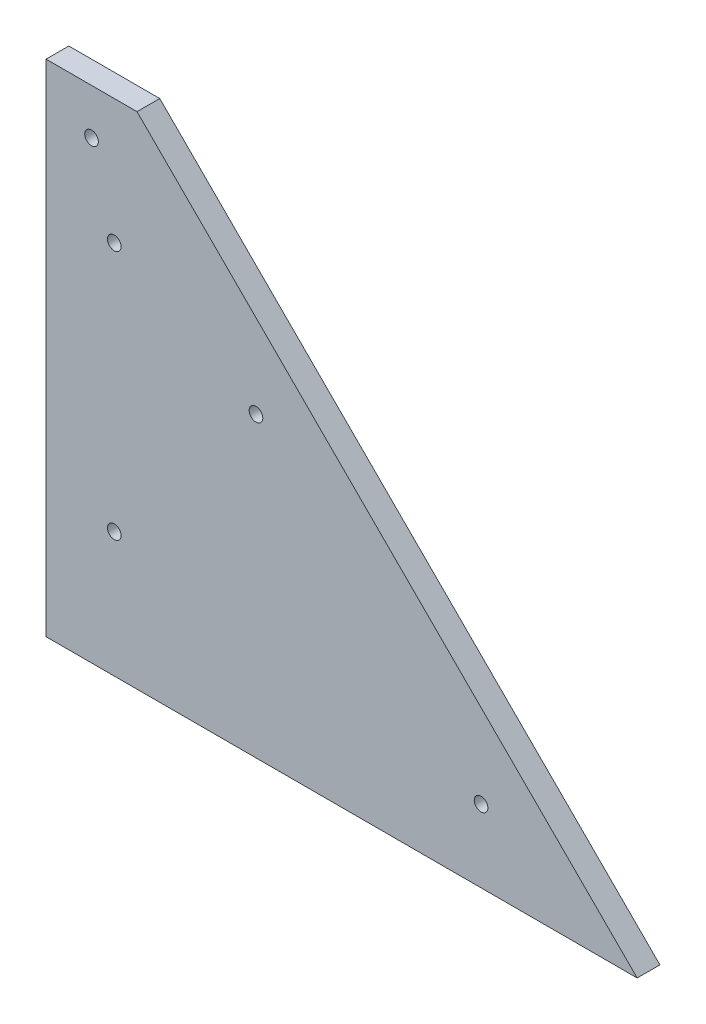
ISO-10303-21;
HEADER;
FILE_DESCRIPTION(('STEP AP214'),'2;1');
FILE_NAME('part.step','',(''),(''),'','','');
FILE_SCHEMA(('AUTOMOTIVE_DESIGN { 1 0 10303 214 1 1 1 1 }'));
ENDSEC;
DATA;
#1=APPLICATION_CONTEXT('core data for automotive mechanical design processes');
#2=APPLICATION_PROTOCOL_DEFINITION('international standard','automotive_design',2000,#1);
#3=PRODUCT_CONTEXT('',#1,'mechanical');
#4=PRODUCT('Part','Part','',(#3));
#5=PRODUCT_RELATED_PRODUCT_CATEGORY('part','',(#4));
#6=PRODUCT_DEFINITION_FORMATION('','',#4);
#7=PRODUCT_DEFINITION_CONTEXT('part definition',#1,'design');
#8=PRODUCT_DEFINITION('design','',#6,#7);
#9=PRODUCT_DEFINITION_SHAPE('','',#8);
#10=(LENGTH_UNIT() NAMED_UNIT(*) SI_UNIT(.MILLI.,.METRE.));
#11=(NAMED_UNIT(*) PLANE_ANGLE_UNIT() SI_UNIT($,.RADIAN.));
#12=(NAMED_UNIT(*) SI_UNIT($,.STERADIAN.) SOLID_ANGLE_UNIT());
#13=UNCERTAINTY_MEASURE_WITH_UNIT(LENGTH_MEASURE(1.E-05),#10,'distance_accuracy_value','');
#14=(GEOMETRIC_REPRESENTATION_CONTEXT(3) GLOBAL_UNCERTAINTY_ASSIGNED_CONTEXT((#13)) GLOBAL_UNIT_ASSIGNED_CONTEXT((#10,
#11,#12)) REPRESENTATION_CONTEXT('',''));
#15=CARTESIAN_POINT('',(0.,0.,0.));
#16=DIRECTION('',(0.,0.,1.));
#17=DIRECTION('',(1.,0.,0.));
#18=AXIS2_PLACEMENT_3D('',#15,#16,#17);
#19=CARTESIAN_POINT('',(0.,0.,5.));
#20=DIRECTION('',(0.,1.,0.));
#21=DIRECTION('',(0.,0.,1.));
#22=AXIS2_PLACEMENT_3D('',#19,#20,#21);
#23=PLANE('',#22);
#24=DIRECTION('',(1.,0.,0.));
#25=VECTOR('',#24,1.);
#26=CARTESIAN_POINT('',(0.,0.,0.));
#27=LINE('',#26,#25);
#28=CARTESIAN_POINT('',(0.,0.,0.));
#29=VERTEX_POINT('',#28);
#30=CARTESIAN_POINT('',(130.000000000001,0.,0.));
#31=VERTEX_POINT('',#30);
#32=EDGE_CURVE('E97',#29,#31,#27,.T.);
#33=ORIENTED_EDGE('',*,*,#32,.T.);
#34=DIRECTION('',(0.,0.,-1.));
#35=VECTOR('',#34,1.);
#36=CARTESIAN_POINT('',(130.000000000001,0.,5.));
#37=LINE('',#36,#35);
#38=CARTESIAN_POINT('',(130.000000000001,0.,5.));
#39=VERTEX_POINT('',#38);
#40=EDGE_CURVE('E11',#39,#31,#37,.T.);
#41=ORIENTED_EDGE('',*,*,#40,.F.);
#42=DIRECTION('',(1.,0.,0.));
#43=VECTOR('',#42,1.);
#44=CARTESIAN_POINT('',(0.,0.,5.));
#45=LINE('',#44,#43);
#46=CARTESIAN_POINT('',(0.,0.,5.));
#47=VERTEX_POINT('',#46);
#48=EDGE_CURVE('E85',#47,#39,#45,.T.);
#49=ORIENTED_EDGE('',*,*,#48,.F.);
#50=DIRECTION('',(0.,0.,-1.));
#51=VECTOR('',#50,1.);
#52=CARTESIAN_POINT('',(0.,0.,5.));
#53=LINE('',#52,#51);
#54=EDGE_CURVE('E93',#47,#29,#53,.T.);
#55=ORIENTED_EDGE('',*,*,#54,.T.);
#56=EDGE_LOOP('',(#33,#41,#49,#55));
#57=FACE_BOUND('',#56,.T.);
#58=ADVANCED_FACE('F34',(#57),#23,.F.);
#59=CARTESIAN_POINT('',(20.,110.,5.));
#60=DIRECTION('',(-0.707106781186543,-0.707106781186552,0.));
#61=DIRECTION('',(0.707106781186552,-0.707106781186543,0.));
#62=AXIS2_PLACEMENT_3D('',#59,#60,#61);
#63=PLANE('',#62);
#64=DIRECTION('',(-0.707106781186552,0.707106781186543,0.));
#65=VECTOR('',#64,1.);
#66=CARTESIAN_POINT('',(20.,110.,0.));
#67=LINE('',#66,#65);
#68=CARTESIAN_POINT('',(20.,110.,0.));
#69=VERTEX_POINT('',#68);
#70=EDGE_CURVE('E89',#31,#69,#67,.T.);
#71=ORIENTED_EDGE('',*,*,#70,.T.);
#72=DIRECTION('',(0.,0.,-1.));
#73=VECTOR('',#72,1.);
#74=CARTESIAN_POINT('',(20.,110.,5.));
#75=LINE('',#74,#73);
#76=CARTESIAN_POINT('',(20.,110.,5.));
#77=VERTEX_POINT('',#76);
#78=EDGE_CURVE('E42',#77,#69,#75,.T.);
#79=ORIENTED_EDGE('',*,*,#78,.F.);
#80=DIRECTION('',(-0.707106781186552,0.707106781186543,0.));
#81=VECTOR('',#80,1.);
#82=CARTESIAN_POINT('',(20.,110.,5.));
#83=LINE('',#82,#81);
#84=EDGE_CURVE('E80',#39,#77,#83,.T.);
#85=ORIENTED_EDGE('',*,*,#84,.F.);
#86=ORIENTED_EDGE('',*,*,#40,.T.);
#87=EDGE_LOOP('',(#71,#79,#85,#86));
#88=FACE_BOUND('',#87,.T.);
#89=ADVANCED_FACE('F88',(#88),#63,.F.);
#90=CARTESIAN_POINT('',(0.,110.,5.));
#91=DIRECTION('',(0.,-1.,0.));
#92=DIRECTION('',(0.,0.,-1.));
#93=AXIS2_PLACEMENT_3D('',#90,#91,#92);
#94=PLANE('',#93);
#95=DIRECTION('',(-1.,0.,0.));
#96=VECTOR('',#95,1.);
#97=CARTESIAN_POINT('',(0.,110.,0.));
#98=LINE('',#97,#96);
#99=CARTESIAN_POINT('',(0.,110.,0.));
#100=VERTEX_POINT('',#99);
#101=EDGE_CURVE('E67',#69,#100,#98,.T.);
#102=ORIENTED_EDGE('',*,*,#101,.T.);
#103=DIRECTION('',(0.,0.,-1.));
#104=VECTOR('',#103,1.);
#105=CARTESIAN_POINT('',(0.,110.,5.));
#106=LINE('',#105,#104);
#107=CARTESIAN_POINT('',(0.,110.,5.));
#108=VERTEX_POINT('',#107);
#109=EDGE_CURVE('E90',#108,#100,#106,.T.);
#110=ORIENTED_EDGE('',*,*,#109,.F.);
#111=DIRECTION('',(-1.,0.,0.));
#112=VECTOR('',#111,1.);
#113=CARTESIAN_POINT('',(0.,110.,5.));
#114=LINE('',#113,#112);
#115=EDGE_CURVE('E83',#77,#108,#114,.T.);
#116=ORIENTED_EDGE('',*,*,#115,.F.);
#117=ORIENTED_EDGE('',*,*,#78,.T.);
#118=EDGE_LOOP('',(#102,#110,#116,#117));
#119=FACE_BOUND('',#118,.T.);
#120=ADVANCED_FACE('F91',(#119),#94,.F.);
#121=CARTESIAN_POINT('',(0.,0.,5.));
#122=DIRECTION('',(1.,0.,0.));
#123=DIRECTION('',(0.,0.,-1.));
#124=AXIS2_PLACEMENT_3D('',#121,#122,#123);
#125=PLANE('',#124);
#126=DIRECTION('',(0.,-1.,0.));
#127=VECTOR('',#126,1.);
#128=CARTESIAN_POINT('',(0.,0.,0.));
#129=LINE('',#128,#127);
#130=EDGE_CURVE('E73',#100,#29,#129,.T.);
#131=ORIENTED_EDGE('',*,*,#130,.T.);
#132=ORIENTED_EDGE('',*,*,#54,.F.);
#133=DIRECTION('',(0.,-1.,0.));
#134=VECTOR('',#133,1.);
#135=CARTESIAN_POINT('',(0.,0.,5.));
#136=LINE('',#135,#134);
#137=EDGE_CURVE('E50',#108,#47,#136,.T.);
#138=ORIENTED_EDGE('',*,*,#137,.F.);
#139=ORIENTED_EDGE('',*,*,#109,.T.);
#140=EDGE_LOOP('',(#131,#132,#138,#139));
#141=FACE_BOUND('',#140,.T.);
#142=ADVANCED_FACE('F105',(#141),#125,.F.);
#143=CARTESIAN_POINT('',(0.,0.,5.));
#144=DIRECTION('',(0.,0.,1.));
#145=DIRECTION('',(1.,0.,0.));
#146=AXIS2_PLACEMENT_3D('',#143,#144,#145);
#147=PLANE('',#146);
#148=CARTESIAN_POINT('',(10.,100.,5.));
#149=DIRECTION('',(0.,0.,1.));
#150=DIRECTION('',(1.,0.,0.));
#151=AXIS2_PLACEMENT_3D('',#148,#149,#150);
#152=CIRCLE('',#151,1.5);
#153=CARTESIAN_POINT('',(11.5,100.,5.));
#154=VERTEX_POINT('',#153);
#155=EDGE_CURVE('E135',#154,#154,#152,.T.);
#156=ORIENTED_EDGE('',*,*,#155,.F.);
#157=EDGE_LOOP('',(#156));
#158=FACE_BOUND('',#157,.T.);
#159=CARTESIAN_POINT('',(46.1629509039029,65.4522727852482,5.));
#160=DIRECTION('',(0.,0.,1.));
#161=DIRECTION('',(1.,0.,0.));
#162=AXIS2_PLACEMENT_3D('',#159,#160,#161);
#163=CIRCLE('',#162,1.5);
#164=CARTESIAN_POINT('',(47.6629509039029,65.4522727852482,5.));
#165=VERTEX_POINT('',#164);
#166=EDGE_CURVE('E130',#165,#165,#163,.T.);
#167=ORIENTED_EDGE('',*,*,#166,.F.);
#168=EDGE_LOOP('',(#167));
#169=FACE_BOUND('',#168,.T.);
#170=CARTESIAN_POINT('',(95.6604255869613,15.9547981021899,5.));
#171=DIRECTION('',(0.,0.,1.));
#172=DIRECTION('',(-1.,0.,0.));
#173=AXIS2_PLACEMENT_3D('',#170,#171,#172);
#174=CIRCLE('',#173,1.50000000000001);
#175=CARTESIAN_POINT('',(94.1604255869612,15.9547981021899,5.));
#176=VERTEX_POINT('',#175);
#177=EDGE_CURVE('E123',#176,#176,#174,.T.);
#178=ORIENTED_EDGE('',*,*,#177,.F.);
#179=EDGE_LOOP('',(#178));
#180=FACE_BOUND('',#179,.T.);
#181=CARTESIAN_POINT('',(15.,82.5,5.));
#182=DIRECTION('',(0.,0.,1.));
#183=DIRECTION('',(1.,0.,0.));
#184=AXIS2_PLACEMENT_3D('',#181,#182,#183);
#185=CIRCLE('',#184,1.5);
#186=CARTESIAN_POINT('',(16.5,82.5,5.));
#187=VERTEX_POINT('',#186);
#188=EDGE_CURVE('E118',#187,#187,#185,.T.);
#189=ORIENTED_EDGE('',*,*,#188,.F.);
#190=EDGE_LOOP('',(#189));
#191=FACE_BOUND('',#190,.T.);
#192=CARTESIAN_POINT('',(15.,27.5,5.));
#193=DIRECTION('',(0.,0.,1.));
#194=DIRECTION('',(-1.,0.,0.));
#195=AXIS2_PLACEMENT_3D('',#192,#193,#194);
#196=CIRCLE('',#195,1.5);
#197=CARTESIAN_POINT('',(13.5,27.5,5.));
#198=VERTEX_POINT('',#197);
#199=EDGE_CURVE('E111',#198,#198,#196,.T.);
#200=ORIENTED_EDGE('',*,*,#199,.F.);
#201=EDGE_LOOP('',(#200));
#202=FACE_BOUND('',#201,.T.);
#203=ORIENTED_EDGE('',*,*,#48,.T.);
#204=ORIENTED_EDGE('',*,*,#84,.T.);
#205=ORIENTED_EDGE('',*,*,#115,.T.);
#206=ORIENTED_EDGE('',*,*,#137,.T.);
#207=EDGE_LOOP('',(#203,#204,#205,#206));
#208=FACE_BOUND('',#207,.T.);
#209=ADVANCED_FACE('F81',(#158,#169,#180,#191,#202,#208),#147,.T.);
#210=CARTESIAN_POINT('',(0.,0.,0.));
#211=DIRECTION('',(0.,0.,1.));
#212=DIRECTION('',(1.,0.,0.));
#213=AXIS2_PLACEMENT_3D('',#210,#211,#212);
#214=PLANE('',#213);
#215=CARTESIAN_POINT('',(10.,100.,0.));
#216=DIRECTION('',(0.,0.,1.));
#217=DIRECTION('',(1.,0.,0.));
#218=AXIS2_PLACEMENT_3D('',#215,#216,#217);
#219=CIRCLE('',#218,1.5);
#220=CARTESIAN_POINT('',(11.5,100.,0.));
#221=VERTEX_POINT('',#220);
#222=EDGE_CURVE('E127',#221,#221,#219,.T.);
#223=ORIENTED_EDGE('',*,*,#222,.T.);
#224=EDGE_LOOP('',(#223));
#225=FACE_BOUND('',#224,.T.);
#226=CARTESIAN_POINT('',(46.1629509039029,65.4522727852482,0.));
#227=DIRECTION('',(0.,0.,1.));
#228=DIRECTION('',(1.,0.,0.));
#229=AXIS2_PLACEMENT_3D('',#226,#227,#228);
#230=CIRCLE('',#229,1.5);
#231=CARTESIAN_POINT('',(47.6629509039029,65.4522727852482,0.));
#232=VERTEX_POINT('',#231);
#233=EDGE_CURVE('E115',#232,#232,#230,.T.);
#234=ORIENTED_EDGE('',*,*,#233,.T.);
#235=EDGE_LOOP('',(#234));
#236=FACE_BOUND('',#235,.T.);
#237=CARTESIAN_POINT('',(95.6604255869613,15.9547981021899,0.));
#238=DIRECTION('',(0.,0.,1.));
#239=DIRECTION('',(-1.,0.,0.));
#240=AXIS2_PLACEMENT_3D('',#237,#238,#239);
#241=CIRCLE('',#240,1.50000000000001);
#242=CARTESIAN_POINT('',(94.1604255869612,15.9547981021899,0.));
#243=VERTEX_POINT('',#242);
#244=EDGE_CURVE('E126',#243,#243,#241,.T.);
#245=ORIENTED_EDGE('',*,*,#244,.T.);
#246=EDGE_LOOP('',(#245));
#247=FACE_BOUND('',#246,.T.);
#248=CARTESIAN_POINT('',(15.,82.5,0.));
#249=DIRECTION('',(0.,0.,1.));
#250=DIRECTION('',(1.,0.,0.));
#251=AXIS2_PLACEMENT_3D('',#248,#249,#250);
#252=CIRCLE('',#251,1.5);
#253=CARTESIAN_POINT('',(16.5,82.5,0.));
#254=VERTEX_POINT('',#253);
#255=EDGE_CURVE('E100',#254,#254,#252,.T.);
#256=ORIENTED_EDGE('',*,*,#255,.T.);
#257=EDGE_LOOP('',(#256));
#258=FACE_BOUND('',#257,.T.);
#259=CARTESIAN_POINT('',(15.,27.5,0.));
#260=DIRECTION('',(0.,0.,1.));
#261=DIRECTION('',(-1.,0.,0.));
#262=AXIS2_PLACEMENT_3D('',#259,#260,#261);
#263=CIRCLE('',#262,1.5);
#264=CARTESIAN_POINT('',(13.5,27.5,0.));
#265=VERTEX_POINT('',#264);
#266=EDGE_CURVE('E114',#265,#265,#263,.T.);
#267=ORIENTED_EDGE('',*,*,#266,.T.);
#268=EDGE_LOOP('',(#267));
#269=FACE_BOUND('',#268,.T.);
#270=ORIENTED_EDGE('',*,*,#32,.F.);
#271=ORIENTED_EDGE('',*,*,#130,.F.);
#272=ORIENTED_EDGE('',*,*,#101,.F.);
#273=ORIENTED_EDGE('',*,*,#70,.F.);
#274=EDGE_LOOP('',(#270,#271,#272,#273));
#275=FACE_BOUND('',#274,.T.);
#276=ADVANCED_FACE('F108',(#225,#236,#247,#258,#269,#275),#214,.F.);
#277=CARTESIAN_POINT('',(15.,27.5,0.));
#278=DIRECTION('',(0.,0.,1.));
#279=DIRECTION('',(1.,0.,0.));
#280=AXIS2_PLACEMENT_3D('',#277,#278,#279);
#281=CYLINDRICAL_SURFACE('',#280,1.5);
#282=ORIENTED_EDGE('',*,*,#266,.F.);
#283=EDGE_LOOP('',(#282));
#284=FACE_BOUND('',#283,.T.);
#285=ORIENTED_EDGE('',*,*,#199,.T.);
#286=EDGE_LOOP('',(#285));
#287=FACE_BOUND('',#286,.T.);
#288=ADVANCED_FACE('F161',(#284,#287),#281,.F.);
#289=CARTESIAN_POINT('',(15.,82.5,0.));
#290=DIRECTION('',(0.,0.,1.));
#291=DIRECTION('',(1.,0.,0.));
#292=AXIS2_PLACEMENT_3D('',#289,#290,#291);
#293=CYLINDRICAL_SURFACE('',#292,1.5);
#294=ORIENTED_EDGE('',*,*,#255,.F.);
#295=EDGE_LOOP('',(#294));
#296=FACE_BOUND('',#295,.T.);
#297=ORIENTED_EDGE('',*,*,#188,.T.);
#298=EDGE_LOOP('',(#297));
#299=FACE_BOUND('',#298,.T.);
#300=ADVANCED_FACE('F163',(#296,#299),#293,.F.);
#301=CARTESIAN_POINT('',(95.6604255869613,15.9547981021899,0.));
#302=DIRECTION('',(0.,0.,1.));
#303=DIRECTION('',(1.,0.,0.));
#304=AXIS2_PLACEMENT_3D('',#301,#302,#303);
#305=CYLINDRICAL_SURFACE('',#304,1.50000000000001);
#306=ORIENTED_EDGE('',*,*,#244,.F.);
#307=EDGE_LOOP('',(#306));
#308=FACE_BOUND('',#307,.T.);
#309=ORIENTED_EDGE('',*,*,#177,.T.);
#310=EDGE_LOOP('',(#309));
#311=FACE_BOUND('',#310,.T.);
#312=ADVANCED_FACE('F170',(#308,#311),#305,.F.);
#313=CARTESIAN_POINT('',(46.1629509039029,65.4522727852482,0.));
#314=DIRECTION('',(0.,0.,1.));
#315=DIRECTION('',(1.,0.,0.));
#316=AXIS2_PLACEMENT_3D('',#313,#314,#315);
#317=CYLINDRICAL_SURFACE('',#316,1.5);
#318=ORIENTED_EDGE('',*,*,#233,.F.);
#319=EDGE_LOOP('',(#318));
#320=FACE_BOUND('',#319,.T.);
#321=ORIENTED_EDGE('',*,*,#166,.T.);
#322=EDGE_LOOP('',(#321));
#323=FACE_BOUND('',#322,.T.);
#324=ADVANCED_FACE('F146',(#320,#323),#317,.F.);
#325=CARTESIAN_POINT('',(10.,100.,0.));
#326=DIRECTION('',(0.,0.,1.));
#327=DIRECTION('',(1.,0.,0.));
#328=AXIS2_PLACEMENT_3D('',#325,#326,#327);
#329=CYLINDRICAL_SURFACE('',#328,1.5);
#330=ORIENTED_EDGE('',*,*,#222,.F.);
#331=EDGE_LOOP('',(#330));
#332=FACE_BOUND('',#331,.T.);
#333=ORIENTED_EDGE('',*,*,#155,.T.);
#334=EDGE_LOOP('',(#333));
#335=FACE_BOUND('',#334,.T.);
#336=ADVANCED_FACE('F143',(#332,#335),#329,.F.);
#337=CLOSED_SHELL('',(#58,#89,#120,#142,#209,#276,#288,#300,#312,#324,#336));
#338=MANIFOLD_SOLID_BREP('B2',#337);
#339=ADVANCED_BREP_SHAPE_REPRESENTATION('',(#18,#338),#14);
#340=SHAPE_DEFINITION_REPRESENTATION(#9,#339);
ENDSEC;
END-ISO-10303-21;
